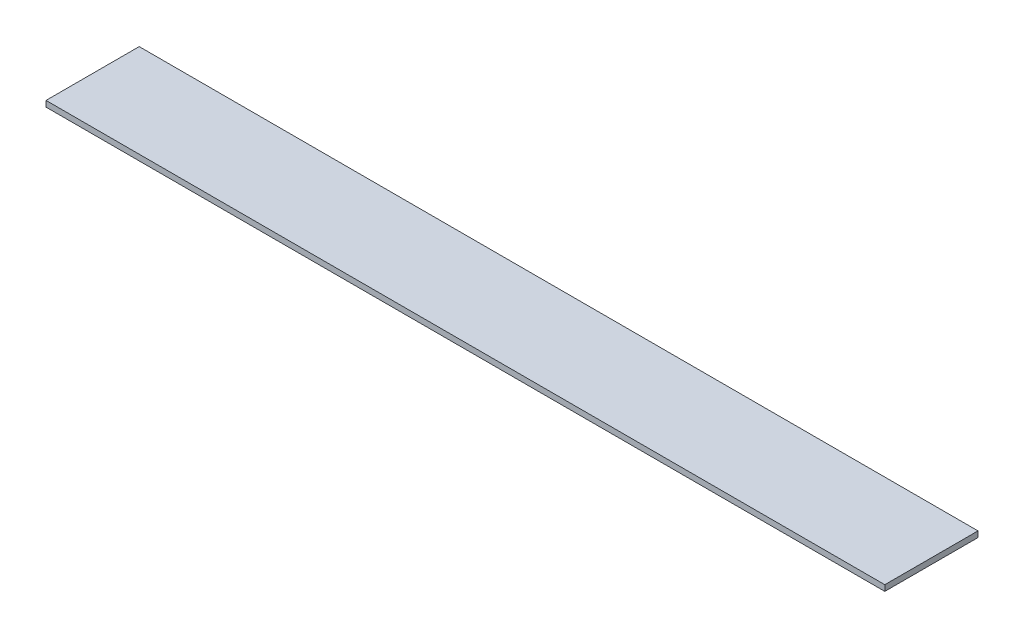
ISO-10303-21;
HEADER;
FILE_DESCRIPTION(('STEP AP214'),'2;1');
FILE_NAME('part.step','',(''),(''),'','','');
FILE_SCHEMA(('AUTOMOTIVE_DESIGN { 1 0 10303 214 1 1 1 1 }'));
ENDSEC;
DATA;
#1=APPLICATION_CONTEXT('core data for automotive mechanical design processes');
#2=APPLICATION_PROTOCOL_DEFINITION('international standard','automotive_design',2000,#1);
#3=PRODUCT_CONTEXT('',#1,'mechanical');
#4=PRODUCT('Part','Part','',(#3));
#5=PRODUCT_RELATED_PRODUCT_CATEGORY('part','',(#4));
#6=PRODUCT_DEFINITION_FORMATION('','',#4);
#7=PRODUCT_DEFINITION_CONTEXT('part definition',#1,'design');
#8=PRODUCT_DEFINITION('design','',#6,#7);
#9=PRODUCT_DEFINITION_SHAPE('','',#8);
#10=(LENGTH_UNIT() NAMED_UNIT(*) SI_UNIT(.MILLI.,.METRE.));
#11=(NAMED_UNIT(*) PLANE_ANGLE_UNIT() SI_UNIT($,.RADIAN.));
#12=(NAMED_UNIT(*) SI_UNIT($,.STERADIAN.) SOLID_ANGLE_UNIT());
#13=UNCERTAINTY_MEASURE_WITH_UNIT(LENGTH_MEASURE(1.E-05),#10,'distance_accuracy_value','');
#14=(GEOMETRIC_REPRESENTATION_CONTEXT(3) GLOBAL_UNCERTAINTY_ASSIGNED_CONTEXT((#13)) GLOBAL_UNIT_ASSIGNED_CONTEXT((#10,
#11,#12)) REPRESENTATION_CONTEXT('',''));
#15=CARTESIAN_POINT('',(0.,0.,0.));
#16=DIRECTION('',(0.,0.,1.));
#17=DIRECTION('',(1.,0.,0.));
#18=AXIS2_PLACEMENT_3D('',#15,#16,#17);
#19=CARTESIAN_POINT('',(0.,1.5875,0.));
#20=DIRECTION('',(1.,0.,0.));
#21=DIRECTION('',(0.,0.,-1.));
#22=AXIS2_PLACEMENT_3D('',#19,#20,#21);
#23=PLANE('',#22);
#24=DIRECTION('',(0.,0.,1.));
#25=VECTOR('',#24,1.);
#26=CARTESIAN_POINT('',(0.,0.,0.));
#27=LINE('',#26,#25);
#28=CARTESIAN_POINT('',(0.,0.,-25.4));
#29=VERTEX_POINT('',#28);
#30=CARTESIAN_POINT('',(0.,0.,0.));
#31=VERTEX_POINT('',#30);
#32=EDGE_CURVE('E95',#29,#31,#27,.T.);
#33=ORIENTED_EDGE('',*,*,#32,.T.);
#34=DIRECTION('',(0.,-1.,0.));
#35=VECTOR('',#34,1.);
#36=CARTESIAN_POINT('',(0.,1.5875,0.));
#37=LINE('',#36,#35);
#38=CARTESIAN_POINT('',(0.,1.5875,0.));
#39=VERTEX_POINT('',#38);
#40=EDGE_CURVE('E11',#39,#31,#37,.T.);
#41=ORIENTED_EDGE('',*,*,#40,.F.);
#42=DIRECTION('',(0.,0.,1.));
#43=VECTOR('',#42,1.);
#44=CARTESIAN_POINT('',(0.,1.5875,0.));
#45=LINE('',#44,#43);
#46=CARTESIAN_POINT('',(0.,1.5875,-25.4));
#47=VERTEX_POINT('',#46);
#48=EDGE_CURVE('E83',#47,#39,#45,.T.);
#49=ORIENTED_EDGE('',*,*,#48,.F.);
#50=DIRECTION('',(0.,-1.,0.));
#51=VECTOR('',#50,1.);
#52=CARTESIAN_POINT('',(0.,1.5875,-25.4));
#53=LINE('',#52,#51);
#54=EDGE_CURVE('E91',#47,#29,#53,.T.);
#55=ORIENTED_EDGE('',*,*,#54,.T.);
#56=EDGE_LOOP('',(#33,#41,#49,#55));
#57=FACE_BOUND('',#56,.T.);
#58=ADVANCED_FACE('F32',(#57),#23,.F.);
#59=CARTESIAN_POINT('',(0.,1.5875,0.));
#60=DIRECTION('',(0.,0.,-1.));
#61=DIRECTION('',(-1.,0.,0.));
#62=AXIS2_PLACEMENT_3D('',#59,#60,#61);
#63=PLANE('',#62);
#64=DIRECTION('',(1.,0.,0.));
#65=VECTOR('',#64,1.);
#66=CARTESIAN_POINT('',(0.,0.,0.));
#67=LINE('',#66,#65);
#68=CARTESIAN_POINT('',(228.6,0.,0.));
#69=VERTEX_POINT('',#68);
#70=EDGE_CURVE('E87',#31,#69,#67,.T.);
#71=ORIENTED_EDGE('',*,*,#70,.T.);
#72=DIRECTION('',(0.,-1.,0.));
#73=VECTOR('',#72,1.);
#74=CARTESIAN_POINT('',(228.6,1.5875,0.));
#75=LINE('',#74,#73);
#76=CARTESIAN_POINT('',(228.6,1.5875,0.));
#77=VERTEX_POINT('',#76);
#78=EDGE_CURVE('E40',#77,#69,#75,.T.);
#79=ORIENTED_EDGE('',*,*,#78,.F.);
#80=DIRECTION('',(1.,0.,0.));
#81=VECTOR('',#80,1.);
#82=CARTESIAN_POINT('',(0.,1.5875,0.));
#83=LINE('',#82,#81);
#84=EDGE_CURVE('E78',#39,#77,#83,.T.);
#85=ORIENTED_EDGE('',*,*,#84,.F.);
#86=ORIENTED_EDGE('',*,*,#40,.T.);
#87=EDGE_LOOP('',(#71,#79,#85,#86));
#88=FACE_BOUND('',#87,.T.);
#89=ADVANCED_FACE('F86',(#88),#63,.F.);
#90=CARTESIAN_POINT('',(228.6,1.5875,0.));
#91=DIRECTION('',(-1.,0.,0.));
#92=DIRECTION('',(0.,0.,1.));
#93=AXIS2_PLACEMENT_3D('',#90,#91,#92);
#94=PLANE('',#93);
#95=DIRECTION('',(0.,0.,-1.));
#96=VECTOR('',#95,1.);
#97=CARTESIAN_POINT('',(228.6,0.,0.));
#98=LINE('',#97,#96);
#99=CARTESIAN_POINT('',(228.6,0.,-25.4));
#100=VERTEX_POINT('',#99);
#101=EDGE_CURVE('E65',#69,#100,#98,.T.);
#102=ORIENTED_EDGE('',*,*,#101,.T.);
#103=DIRECTION('',(0.,-1.,0.));
#104=VECTOR('',#103,1.);
#105=CARTESIAN_POINT('',(228.6,1.5875,-25.4));
#106=LINE('',#105,#104);
#107=CARTESIAN_POINT('',(228.6,1.5875,-25.4));
#108=VERTEX_POINT('',#107);
#109=EDGE_CURVE('E88',#108,#100,#106,.T.);
#110=ORIENTED_EDGE('',*,*,#109,.F.);
#111=DIRECTION('',(0.,0.,-1.));
#112=VECTOR('',#111,1.);
#113=CARTESIAN_POINT('',(228.6,1.5875,0.));
#114=LINE('',#113,#112);
#115=EDGE_CURVE('E81',#77,#108,#114,.T.);
#116=ORIENTED_EDGE('',*,*,#115,.F.);
#117=ORIENTED_EDGE('',*,*,#78,.T.);
#118=EDGE_LOOP('',(#102,#110,#116,#117));
#119=FACE_BOUND('',#118,.T.);
#120=ADVANCED_FACE('F89',(#119),#94,.F.);
#121=CARTESIAN_POINT('',(0.,1.5875,-25.4));
#122=DIRECTION('',(0.,0.,1.));
#123=DIRECTION('',(1.,0.,0.));
#124=AXIS2_PLACEMENT_3D('',#121,#122,#123);
#125=PLANE('',#124);
#126=DIRECTION('',(-1.,0.,0.));
#127=VECTOR('',#126,1.);
#128=CARTESIAN_POINT('',(0.,0.,-25.4));
#129=LINE('',#128,#127);
#130=EDGE_CURVE('E71',#100,#29,#129,.T.);
#131=ORIENTED_EDGE('',*,*,#130,.T.);
#132=ORIENTED_EDGE('',*,*,#54,.F.);
#133=DIRECTION('',(-1.,0.,0.));
#134=VECTOR('',#133,1.);
#135=CARTESIAN_POINT('',(0.,1.5875,-25.4));
#136=LINE('',#135,#134);
#137=EDGE_CURVE('E48',#108,#47,#136,.T.);
#138=ORIENTED_EDGE('',*,*,#137,.F.);
#139=ORIENTED_EDGE('',*,*,#109,.T.);
#140=EDGE_LOOP('',(#131,#132,#138,#139));
#141=FACE_BOUND('',#140,.T.);
#142=ADVANCED_FACE('F102',(#141),#125,.F.);
#143=CARTESIAN_POINT('',(0.,1.5875,0.));
#144=DIRECTION('',(0.,-1.,0.));
#145=DIRECTION('',(0.,0.,-1.));
#146=AXIS2_PLACEMENT_3D('',#143,#144,#145);
#147=PLANE('',#146);
#148=ORIENTED_EDGE('',*,*,#48,.T.);
#149=ORIENTED_EDGE('',*,*,#84,.T.);
#150=ORIENTED_EDGE('',*,*,#115,.T.);
#151=ORIENTED_EDGE('',*,*,#137,.T.);
#152=EDGE_LOOP('',(#148,#149,#150,#151));
#153=FACE_BOUND('',#152,.T.);
#154=ADVANCED_FACE('F79',(#153),#147,.F.);
#155=CARTESIAN_POINT('',(0.,0.,0.));
#156=DIRECTION('',(0.,-1.,0.));
#157=DIRECTION('',(0.,0.,-1.));
#158=AXIS2_PLACEMENT_3D('',#155,#156,#157);
#159=PLANE('',#158);
#160=ORIENTED_EDGE('',*,*,#32,.F.);
#161=ORIENTED_EDGE('',*,*,#130,.F.);
#162=ORIENTED_EDGE('',*,*,#101,.F.);
#163=ORIENTED_EDGE('',*,*,#70,.F.);
#164=EDGE_LOOP('',(#160,#161,#162,#163));
#165=FACE_BOUND('',#164,.T.);
#166=ADVANCED_FACE('F105',(#165),#159,.T.);
#167=CLOSED_SHELL('',(#58,#89,#120,#142,#154,#166));
#168=MANIFOLD_SOLID_BREP('B2',#167);
#169=ADVANCED_BREP_SHAPE_REPRESENTATION('',(#18,#168),#14);
#170=SHAPE_DEFINITION_REPRESENTATION(#9,#169);
ENDSEC;
END-ISO-10303-21;
